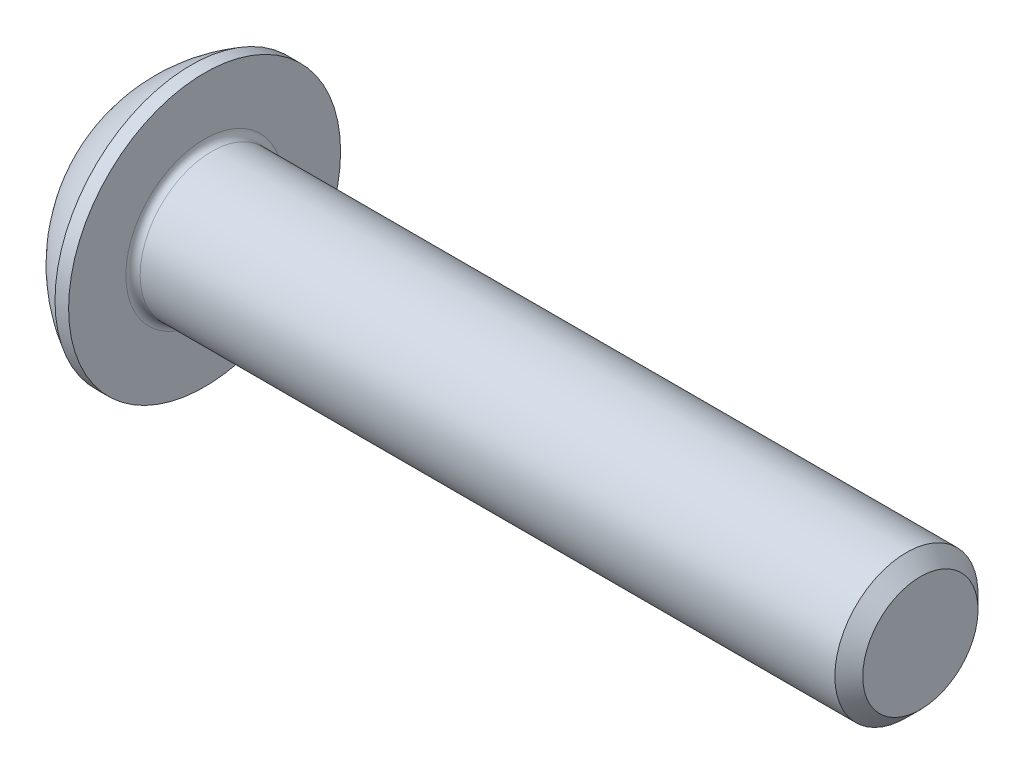
ISO-10303-21;
HEADER;
FILE_DESCRIPTION(('STEP AP214'),'2;1');
FILE_NAME('part.step','',(''),(''),'','','');
FILE_SCHEMA(('AUTOMOTIVE_DESIGN { 1 0 10303 214 1 1 1 1 }'));
ENDSEC;
DATA;
#1=APPLICATION_CONTEXT('core data for automotive mechanical design processes');
#2=APPLICATION_PROTOCOL_DEFINITION('international standard','automotive_design',2000,#1);
#3=PRODUCT_CONTEXT('',#1,'mechanical');
#4=PRODUCT('Part','Part','',(#3));
#5=PRODUCT_RELATED_PRODUCT_CATEGORY('part','',(#4));
#6=PRODUCT_DEFINITION_FORMATION('','',#4);
#7=PRODUCT_DEFINITION_CONTEXT('part definition',#1,'design');
#8=PRODUCT_DEFINITION('design','',#6,#7);
#9=PRODUCT_DEFINITION_SHAPE('','',#8);
#10=(LENGTH_UNIT() NAMED_UNIT(*) SI_UNIT(.MILLI.,.METRE.));
#11=(NAMED_UNIT(*) PLANE_ANGLE_UNIT() SI_UNIT($,.RADIAN.));
#12=(NAMED_UNIT(*) SI_UNIT($,.STERADIAN.) SOLID_ANGLE_UNIT());
#13=UNCERTAINTY_MEASURE_WITH_UNIT(LENGTH_MEASURE(1.E-05),#10,'distance_accuracy_value','');
#14=(GEOMETRIC_REPRESENTATION_CONTEXT(3) GLOBAL_UNCERTAINTY_ASSIGNED_CONTEXT((#13)) GLOBAL_UNIT_ASSIGNED_CONTEXT((#10,
#11,#12)) REPRESENTATION_CONTEXT('',''));
#15=CARTESIAN_POINT('',(0.,0.,0.));
#16=DIRECTION('',(0.,0.,1.));
#17=DIRECTION('',(1.,0.,0.));
#18=AXIS2_PLACEMENT_3D('',#15,#16,#17);
#19=CARTESIAN_POINT('',(0.,0.,0.));
#20=DIRECTION('',(-1.,0.,0.));
#21=DIRECTION('',(0.,0.,1.));
#22=AXIS2_PLACEMENT_3D('',#19,#20,#21);
#23=PLANE('',#22);
#24=CARTESIAN_POINT('',(0.,0.,0.));
#25=DIRECTION('',(-1.,0.,0.));
#26=DIRECTION('',(0.,0.,1.));
#27=AXIS2_PLACEMENT_3D('',#24,#25,#26);
#28=CIRCLE('',#27,1.9);
#29=CARTESIAN_POINT('',(0.,0.,1.9));
#30=VERTEX_POINT('',#29);
#31=EDGE_CURVE('E155',#30,#30,#28,.T.);
#32=ORIENTED_EDGE('',*,*,#31,.T.);
#33=EDGE_LOOP('',(#32));
#34=FACE_BOUND('',#33,.T.);
#35=DIRECTION('',(0.,-1.,0.));
#36=VECTOR('',#35,1.);
#37=CARTESIAN_POINT('',(0.,-0.721687836487031,1.25));
#38=LINE('',#37,#36);
#39=CARTESIAN_POINT('',(0.,0.721687836487033,1.25));
#40=VERTEX_POINT('',#39);
#41=CARTESIAN_POINT('',(0.,-0.721687836487031,1.25));
#42=VERTEX_POINT('',#41);
#43=EDGE_CURVE('E50',#40,#42,#38,.T.);
#44=ORIENTED_EDGE('',*,*,#43,.T.);
#45=DIRECTION('',(0.,-0.5,-0.866025403784439));
#46=VECTOR('',#45,1.);
#47=CARTESIAN_POINT('',(0.,-1.44337567297406,0.));
#48=LINE('',#47,#46);
#49=CARTESIAN_POINT('',(0.,-1.44337567297406,0.));
#50=VERTEX_POINT('',#49);
#51=EDGE_CURVE('E275',#42,#50,#48,.T.);
#52=ORIENTED_EDGE('',*,*,#51,.T.);
#53=DIRECTION('',(0.,0.5,-0.866025403784439));
#54=VECTOR('',#53,1.);
#55=CARTESIAN_POINT('',(0.,-0.721687836487032,-1.25));
#56=LINE('',#55,#54);
#57=CARTESIAN_POINT('',(0.,-0.721687836487032,-1.25));
#58=VERTEX_POINT('',#57);
#59=EDGE_CURVE('E130',#50,#58,#56,.T.);
#60=ORIENTED_EDGE('',*,*,#59,.T.);
#61=DIRECTION('',(0.,1.,0.));
#62=VECTOR('',#61,1.);
#63=CARTESIAN_POINT('',(0.,0.721687836487033,-1.25));
#64=LINE('',#63,#62);
#65=CARTESIAN_POINT('',(0.,0.721687836487033,-1.25));
#66=VERTEX_POINT('',#65);
#67=EDGE_CURVE('E278',#58,#66,#64,.T.);
#68=ORIENTED_EDGE('',*,*,#67,.T.);
#69=DIRECTION('',(0.,0.499999999999999,0.866025403784439));
#70=VECTOR('',#69,1.);
#71=CARTESIAN_POINT('',(0.,1.44337567297406,0.));
#72=LINE('',#71,#70);
#73=CARTESIAN_POINT('',(0.,1.44337567297406,0.));
#74=VERTEX_POINT('',#73);
#75=EDGE_CURVE('E280',#66,#74,#72,.T.);
#76=ORIENTED_EDGE('',*,*,#75,.T.);
#77=DIRECTION('',(0.,-0.499999999999999,0.866025403784439));
#78=VECTOR('',#77,1.);
#79=CARTESIAN_POINT('',(0.,0.721687836487033,1.25));
#80=LINE('',#79,#78);
#81=EDGE_CURVE('E282',#74,#40,#80,.T.);
#82=ORIENTED_EDGE('',*,*,#81,.T.);
#83=EDGE_LOOP('',(#44,#52,#60,#68,#76,#82));
#84=FACE_BOUND('',#83,.T.);
#85=ADVANCED_FACE('F35',(#34,#84),#23,.T.);
#86=CARTESIAN_POINT('',(3.88527472527473,0.,0.));
#87=DIRECTION('',(-1.,0.,0.));
#88=DIRECTION('',(0.,1.,0.));
#89=AXIS2_PLACEMENT_3D('',#86,#87,#88);
#90=SPHERICAL_SURFACE('',#89,4.32496932831421);
#91=CARTESIAN_POINT('',(1.82,0.,0.));
#92=DIRECTION('',(-1.,0.,0.));
#93=DIRECTION('',(0.,0.,1.));
#94=AXIS2_PLACEMENT_3D('',#91,#92,#93);
#95=CIRCLE('',#94,3.8);
#96=CARTESIAN_POINT('',(1.82,0.,3.8));
#97=VERTEX_POINT('',#96);
#98=EDGE_CURVE('E152',#97,#97,#95,.T.);
#99=ORIENTED_EDGE('',*,*,#98,.T.);
#100=EDGE_LOOP('',(#99));
#101=FACE_BOUND('',#100,.T.);
#102=ORIENTED_EDGE('',*,*,#31,.F.);
#103=EDGE_LOOP('',(#102));
#104=FACE_BOUND('',#103,.T.);
#105=ADVANCED_FACE('F176',(#101,#104),#90,.T.);
#106=CARTESIAN_POINT('',(0.,0.,0.));
#107=DIRECTION('',(-1.,0.,0.));
#108=DIRECTION('',(0.,0.,1.));
#109=AXIS2_PLACEMENT_3D('',#106,#107,#108);
#110=CYLINDRICAL_SURFACE('',#109,3.8);
#111=ORIENTED_EDGE('',*,*,#98,.F.);
#112=EDGE_LOOP('',(#111));
#113=FACE_BOUND('',#112,.T.);
#114=CARTESIAN_POINT('',(2.2,0.,0.));
#115=DIRECTION('',(-1.,0.,0.));
#116=DIRECTION('',(0.,0.,1.));
#117=AXIS2_PLACEMENT_3D('',#114,#115,#116);
#118=CIRCLE('',#117,3.8);
#119=CARTESIAN_POINT('',(2.2,0.,3.8));
#120=VERTEX_POINT('',#119);
#121=EDGE_CURVE('E149',#120,#120,#118,.T.);
#122=ORIENTED_EDGE('',*,*,#121,.T.);
#123=EDGE_LOOP('',(#122));
#124=FACE_BOUND('',#123,.T.);
#125=ADVANCED_FACE('F181',(#113,#124),#110,.T.);
#126=CARTESIAN_POINT('',(2.2,1.99999999999999,0.));
#127=DIRECTION('',(-1.,0.,0.));
#128=DIRECTION('',(0.,0.,1.));
#129=AXIS2_PLACEMENT_3D('',#126,#127,#128);
#130=PLANE('',#129);
#131=CARTESIAN_POINT('',(2.2,0.,0.));
#132=DIRECTION('',(-1.,0.,0.));
#133=DIRECTION('',(0.,0.,1.));
#134=AXIS2_PLACEMENT_3D('',#131,#132,#133);
#135=CIRCLE('',#134,2.2);
#136=CARTESIAN_POINT('',(2.2,0.,2.2));
#137=VERTEX_POINT('',#136);
#138=EDGE_CURVE('E43',#137,#137,#135,.T.);
#139=ORIENTED_EDGE('',*,*,#138,.T.);
#140=EDGE_LOOP('',(#139));
#141=FACE_BOUND('',#140,.T.);
#142=ORIENTED_EDGE('',*,*,#121,.F.);
#143=EDGE_LOOP('',(#142));
#144=FACE_BOUND('',#143,.T.);
#145=ADVANCED_FACE('F160',(#141,#144),#130,.F.);
#146=CARTESIAN_POINT('',(0.,0.,0.));
#147=DIRECTION('',(-1.,0.,0.));
#148=DIRECTION('',(0.,0.,1.));
#149=AXIS2_PLACEMENT_3D('',#146,#147,#148);
#150=CYLINDRICAL_SURFACE('',#149,2.);
#151=CARTESIAN_POINT('',(2.4,0.,0.));
#152=DIRECTION('',(-1.,0.,0.));
#153=DIRECTION('',(0.,0.,1.));
#154=AXIS2_PLACEMENT_3D('',#151,#152,#153);
#155=CIRCLE('',#154,2.);
#156=CARTESIAN_POINT('',(2.4,0.,2.));
#157=VERTEX_POINT('',#156);
#158=EDGE_CURVE('E11',#157,#157,#155,.F.);
#159=ORIENTED_EDGE('',*,*,#158,.T.);
#160=EDGE_LOOP('',(#159));
#161=FACE_BOUND('',#160,.T.);
#162=CARTESIAN_POINT('',(21.81,0.,0.));
#163=DIRECTION('',(-1.,0.,0.));
#164=DIRECTION('',(0.,0.,1.));
#165=AXIS2_PLACEMENT_3D('',#162,#163,#164);
#166=CIRCLE('',#165,2.);
#167=CARTESIAN_POINT('',(21.81,0.,2.));
#168=VERTEX_POINT('',#167);
#169=EDGE_CURVE('E146',#168,#168,#166,.T.);
#170=ORIENTED_EDGE('',*,*,#169,.T.);
#171=EDGE_LOOP('',(#170));
#172=FACE_BOUND('',#171,.T.);
#173=ADVANCED_FACE('F190',(#161,#172),#150,.T.);
#174=CARTESIAN_POINT('',(22.2,0.,0.));
#175=DIRECTION('',(-1.,0.,0.));
#176=DIRECTION('',(0.,0.,1.));
#177=AXIS2_PLACEMENT_3D('',#174,#175,#176);
#178=CONICAL_SURFACE('',#177,1.61,0.785398163397442);
#179=ORIENTED_EDGE('',*,*,#169,.F.);
#180=EDGE_LOOP('',(#179));
#181=FACE_BOUND('',#180,.T.);
#182=CARTESIAN_POINT('',(22.2,0.,0.));
#183=DIRECTION('',(-1.,0.,0.));
#184=DIRECTION('',(0.,0.,1.));
#185=AXIS2_PLACEMENT_3D('',#182,#183,#184);
#186=CIRCLE('',#185,1.61);
#187=CARTESIAN_POINT('',(22.2,0.,1.61));
#188=VERTEX_POINT('',#187);
#189=EDGE_CURVE('E142',#188,#188,#186,.T.);
#190=ORIENTED_EDGE('',*,*,#189,.T.);
#191=EDGE_LOOP('',(#190));
#192=FACE_BOUND('',#191,.T.);
#193=ADVANCED_FACE('F171',(#181,#192),#178,.T.);
#194=CARTESIAN_POINT('',(22.2,0.,0.));
#195=DIRECTION('',(-1.,0.,0.));
#196=DIRECTION('',(0.,0.,1.));
#197=AXIS2_PLACEMENT_3D('',#194,#195,#196);
#198=PLANE('',#197);
#199=ORIENTED_EDGE('',*,*,#189,.F.);
#200=EDGE_LOOP('',(#199));
#201=FACE_BOUND('',#200,.T.);
#202=ADVANCED_FACE('F164',(#201),#198,.F.);
#203=CARTESIAN_POINT('',(2.4,0.,0.));
#204=DIRECTION('',(-1.,0.,0.));
#205=DIRECTION('',(0.,0.,1.));
#206=AXIS2_PLACEMENT_3D('',#203,#204,#205);
#207=TOROIDAL_SURFACE('',#206,2.2,0.2);
#208=ORIENTED_EDGE('',*,*,#158,.F.);
#209=EDGE_LOOP('',(#208));
#210=FACE_BOUND('',#209,.T.);
#211=ORIENTED_EDGE('',*,*,#138,.F.);
#212=EDGE_LOOP('',(#211));
#213=FACE_BOUND('',#212,.T.);
#214=ADVANCED_FACE('F37',(#210,#213),#207,.F.);
#215=CARTESIAN_POINT('',(1.3,-1.44337567297406,0.));
#216=DIRECTION('',(0.,0.866025403784439,-0.5));
#217=DIRECTION('',(0.,0.5,0.866025403784439));
#218=AXIS2_PLACEMENT_3D('',#215,#216,#217);
#219=PLANE('',#218);
#220=DIRECTION('',(0.,-0.5,-0.866025403784439));
#221=VECTOR('',#220,1.);
#222=CARTESIAN_POINT('',(1.3,-1.44337567297406,0.));
#223=LINE('',#222,#221);
#224=CARTESIAN_POINT('',(1.3,-0.721687836487031,1.25));
#225=VERTEX_POINT('',#224);
#226=CARTESIAN_POINT('',(1.3,-1.08253175473055,0.625));
#227=VERTEX_POINT('',#226);
#228=EDGE_CURVE('E116',#225,#227,#223,.T.);
#229=ORIENTED_EDGE('',*,*,#228,.T.);
#230=CARTESIAN_POINT('',(1.3,-1.44337567297406,0.));
#231=VERTEX_POINT('',#230);
#232=EDGE_CURVE('E111',#227,#231,#223,.T.);
#233=ORIENTED_EDGE('',*,*,#232,.T.);
#234=DIRECTION('',(-1.,0.,0.));
#235=VECTOR('',#234,1.);
#236=CARTESIAN_POINT('',(1.3,-1.44337567297406,0.));
#237=LINE('',#236,#235);
#238=EDGE_CURVE('E113',#231,#50,#237,.T.);
#239=ORIENTED_EDGE('',*,*,#238,.T.);
#240=ORIENTED_EDGE('',*,*,#51,.F.);
#241=DIRECTION('',(-1.,0.,0.));
#242=VECTOR('',#241,1.);
#243=CARTESIAN_POINT('',(1.3,-0.721687836487031,1.25));
#244=LINE('',#243,#242);
#245=EDGE_CURVE('E271',#225,#42,#244,.T.);
#246=ORIENTED_EDGE('',*,*,#245,.F.);
#247=EDGE_LOOP('',(#229,#233,#239,#240,#246));
#248=FACE_BOUND('',#247,.T.);
#249=ADVANCED_FACE('F112',(#248),#219,.T.);
#250=CARTESIAN_POINT('',(1.3,-0.721687836487032,-1.25));
#251=DIRECTION('',(0.,0.866025403784439,0.5));
#252=DIRECTION('',(0.,-0.5,0.866025403784439));
#253=AXIS2_PLACEMENT_3D('',#250,#251,#252);
#254=PLANE('',#253);
#255=DIRECTION('',(0.,0.5,-0.866025403784439));
#256=VECTOR('',#255,1.);
#257=CARTESIAN_POINT('',(1.3,-0.721687836487032,-1.25));
#258=LINE('',#257,#256);
#259=CARTESIAN_POINT('',(1.3,-1.08253175473055,-0.625));
#260=VERTEX_POINT('',#259);
#261=EDGE_CURVE('E58',#231,#260,#258,.T.);
#262=ORIENTED_EDGE('',*,*,#261,.T.);
#263=CARTESIAN_POINT('',(1.3,-0.721687836487032,-1.25));
#264=VERTEX_POINT('',#263);
#265=EDGE_CURVE('E125',#260,#264,#258,.T.);
#266=ORIENTED_EDGE('',*,*,#265,.T.);
#267=DIRECTION('',(-1.,0.,0.));
#268=VECTOR('',#267,1.);
#269=CARTESIAN_POINT('',(1.3,-0.721687836487032,-1.25));
#270=LINE('',#269,#268);
#271=EDGE_CURVE('E132',#264,#58,#270,.T.);
#272=ORIENTED_EDGE('',*,*,#271,.T.);
#273=ORIENTED_EDGE('',*,*,#59,.F.);
#274=ORIENTED_EDGE('',*,*,#238,.F.);
#275=EDGE_LOOP('',(#262,#266,#272,#273,#274));
#276=FACE_BOUND('',#275,.T.);
#277=ADVANCED_FACE('F128',(#276),#254,.T.);
#278=CARTESIAN_POINT('',(1.3,0.721687836487033,-1.25));
#279=DIRECTION('',(0.,0.,1.));
#280=DIRECTION('',(1.,0.,0.));
#281=AXIS2_PLACEMENT_3D('',#278,#279,#280);
#282=PLANE('',#281);
#283=DIRECTION('',(0.,1.,0.));
#284=VECTOR('',#283,1.);
#285=CARTESIAN_POINT('',(1.3,0.721687836487033,-1.25));
#286=LINE('',#285,#284);
#287=CARTESIAN_POINT('',(1.3,0.,-1.25));
#288=VERTEX_POINT('',#287);
#289=EDGE_CURVE('E252',#264,#288,#286,.T.);
#290=ORIENTED_EDGE('',*,*,#289,.T.);
#291=CARTESIAN_POINT('',(1.3,0.721687836487033,-1.25));
#292=VERTEX_POINT('',#291);
#293=EDGE_CURVE('E124',#288,#292,#286,.T.);
#294=ORIENTED_EDGE('',*,*,#293,.T.);
#295=DIRECTION('',(-1.,0.,0.));
#296=VECTOR('',#295,1.);
#297=CARTESIAN_POINT('',(1.3,0.721687836487033,-1.25));
#298=LINE('',#297,#296);
#299=EDGE_CURVE('E137',#292,#66,#298,.T.);
#300=ORIENTED_EDGE('',*,*,#299,.T.);
#301=ORIENTED_EDGE('',*,*,#67,.F.);
#302=ORIENTED_EDGE('',*,*,#271,.F.);
#303=EDGE_LOOP('',(#290,#294,#300,#301,#302));
#304=FACE_BOUND('',#303,.T.);
#305=ADVANCED_FACE('F204',(#304),#282,.T.);
#306=CARTESIAN_POINT('',(1.3,1.44337567297406,0.));
#307=DIRECTION('',(0.,-0.866025403784439,0.499999999999999));
#308=DIRECTION('',(0.,-0.499999999999999,-0.866025403784439));
#309=AXIS2_PLACEMENT_3D('',#306,#307,#308);
#310=PLANE('',#309);
#311=DIRECTION('',(0.,0.499999999999999,0.866025403784439));
#312=VECTOR('',#311,1.);
#313=CARTESIAN_POINT('',(1.3,1.44337567297406,0.));
#314=LINE('',#313,#312);
#315=CARTESIAN_POINT('',(1.3,1.08253175473055,-0.624999999999999));
#316=VERTEX_POINT('',#315);
#317=EDGE_CURVE('E241',#292,#316,#314,.T.);
#318=ORIENTED_EDGE('',*,*,#317,.T.);
#319=CARTESIAN_POINT('',(1.3,1.44337567297406,0.));
#320=VERTEX_POINT('',#319);
#321=EDGE_CURVE('E246',#316,#320,#314,.T.);
#322=ORIENTED_EDGE('',*,*,#321,.T.);
#323=DIRECTION('',(-1.,0.,0.));
#324=VECTOR('',#323,1.);
#325=CARTESIAN_POINT('',(1.3,1.44337567297406,0.));
#326=LINE('',#325,#324);
#327=EDGE_CURVE('E286',#320,#74,#326,.T.);
#328=ORIENTED_EDGE('',*,*,#327,.T.);
#329=ORIENTED_EDGE('',*,*,#75,.F.);
#330=ORIENTED_EDGE('',*,*,#299,.F.);
#331=EDGE_LOOP('',(#318,#322,#328,#329,#330));
#332=FACE_BOUND('',#331,.T.);
#333=ADVANCED_FACE('F207',(#332),#310,.T.);
#334=CARTESIAN_POINT('',(1.3,0.721687836487033,1.25));
#335=DIRECTION('',(0.,-0.866025403784439,-0.499999999999999));
#336=DIRECTION('',(0.,0.499999999999999,-0.866025403784439));
#337=AXIS2_PLACEMENT_3D('',#334,#335,#336);
#338=PLANE('',#337);
#339=DIRECTION('',(0.,-0.499999999999999,0.866025403784439));
#340=VECTOR('',#339,1.);
#341=CARTESIAN_POINT('',(1.3,0.721687836487033,1.25));
#342=LINE('',#341,#340);
#343=CARTESIAN_POINT('',(1.3,1.08253175473055,0.624999999999999));
#344=VERTEX_POINT('',#343);
#345=EDGE_CURVE('E249',#320,#344,#342,.T.);
#346=ORIENTED_EDGE('',*,*,#345,.T.);
#347=CARTESIAN_POINT('',(1.3,0.721687836487033,1.25));
#348=VERTEX_POINT('',#347);
#349=EDGE_CURVE('E257',#344,#348,#342,.T.);
#350=ORIENTED_EDGE('',*,*,#349,.T.);
#351=DIRECTION('',(-1.,0.,0.));
#352=VECTOR('',#351,1.);
#353=CARTESIAN_POINT('',(1.3,0.721687836487033,1.25));
#354=LINE('',#353,#352);
#355=EDGE_CURVE('E270',#348,#40,#354,.T.);
#356=ORIENTED_EDGE('',*,*,#355,.T.);
#357=ORIENTED_EDGE('',*,*,#81,.F.);
#358=ORIENTED_EDGE('',*,*,#327,.F.);
#359=EDGE_LOOP('',(#346,#350,#356,#357,#358));
#360=FACE_BOUND('',#359,.T.);
#361=ADVANCED_FACE('F211',(#360),#338,.T.);
#362=CARTESIAN_POINT('',(1.3,-0.721687836487031,1.25));
#363=DIRECTION('',(0.,0.,-1.));
#364=DIRECTION('',(0.,1.,0.));
#365=AXIS2_PLACEMENT_3D('',#362,#363,#364);
#366=PLANE('',#365);
#367=DIRECTION('',(0.,-1.,0.));
#368=VECTOR('',#367,1.);
#369=CARTESIAN_POINT('',(1.3,-0.721687836487031,1.25));
#370=LINE('',#369,#368);
#371=CARTESIAN_POINT('',(1.3,0.,1.25));
#372=VERTEX_POINT('',#371);
#373=EDGE_CURVE('E263',#348,#372,#370,.T.);
#374=ORIENTED_EDGE('',*,*,#373,.T.);
#375=EDGE_CURVE('E265',#372,#225,#370,.T.);
#376=ORIENTED_EDGE('',*,*,#375,.T.);
#377=ORIENTED_EDGE('',*,*,#245,.T.);
#378=ORIENTED_EDGE('',*,*,#43,.F.);
#379=ORIENTED_EDGE('',*,*,#355,.F.);
#380=EDGE_LOOP('',(#374,#376,#377,#378,#379));
#381=FACE_BOUND('',#380,.T.);
#382=ADVANCED_FACE('F215',(#381),#366,.T.);
#383=CARTESIAN_POINT('',(1.3,-2.1650635094611,-1.25));
#384=DIRECTION('',(1.,0.,0.));
#385=DIRECTION('',(0.,0.,-1.));
#386=AXIS2_PLACEMENT_3D('',#383,#384,#385);
#387=PLANE('',#386);
#388=CARTESIAN_POINT('',(1.3,0.,0.));
#389=DIRECTION('',(-1.,0.,0.));
#390=DIRECTION('',(0.,0.,1.));
#391=AXIS2_PLACEMENT_3D('',#388,#389,#390);
#392=CIRCLE('',#391,1.25);
#393=EDGE_CURVE('E238',#316,#288,#392,.T.);
#394=ORIENTED_EDGE('',*,*,#393,.F.);
#395=ORIENTED_EDGE('',*,*,#317,.F.);
#396=ORIENTED_EDGE('',*,*,#293,.F.);
#397=EDGE_LOOP('',(#394,#395,#396));
#398=FACE_BOUND('',#397,.T.);
#399=ADVANCED_FACE('F219',(#398),#387,.F.);
#400=EDGE_CURVE('E143',#344,#316,#392,.T.);
#401=ORIENTED_EDGE('',*,*,#400,.F.);
#402=ORIENTED_EDGE('',*,*,#345,.F.);
#403=ORIENTED_EDGE('',*,*,#321,.F.);
#404=EDGE_LOOP('',(#401,#402,#403));
#405=FACE_BOUND('',#404,.T.);
#406=ADVANCED_FACE('F228',(#405),#387,.F.);
#407=EDGE_CURVE('E136',#372,#344,#392,.T.);
#408=ORIENTED_EDGE('',*,*,#407,.F.);
#409=ORIENTED_EDGE('',*,*,#373,.F.);
#410=ORIENTED_EDGE('',*,*,#349,.F.);
#411=EDGE_LOOP('',(#408,#409,#410));
#412=FACE_BOUND('',#411,.T.);
#413=ADVANCED_FACE('F233',(#412),#387,.F.);
#414=EDGE_CURVE('E131',#227,#372,#392,.T.);
#415=ORIENTED_EDGE('',*,*,#414,.F.);
#416=ORIENTED_EDGE('',*,*,#228,.F.);
#417=ORIENTED_EDGE('',*,*,#375,.F.);
#418=EDGE_LOOP('',(#415,#416,#417));
#419=FACE_BOUND('',#418,.T.);
#420=ADVANCED_FACE('F226',(#419),#387,.F.);
#421=EDGE_CURVE('E122',#260,#227,#392,.T.);
#422=ORIENTED_EDGE('',*,*,#421,.F.);
#423=ORIENTED_EDGE('',*,*,#261,.F.);
#424=ORIENTED_EDGE('',*,*,#232,.F.);
#425=EDGE_LOOP('',(#422,#423,#424));
#426=FACE_BOUND('',#425,.T.);
#427=ADVANCED_FACE('F121',(#426),#387,.F.);
#428=EDGE_CURVE('E244',#288,#260,#392,.T.);
#429=ORIENTED_EDGE('',*,*,#428,.F.);
#430=ORIENTED_EDGE('',*,*,#289,.F.);
#431=ORIENTED_EDGE('',*,*,#265,.F.);
#432=EDGE_LOOP('',(#429,#430,#431));
#433=FACE_BOUND('',#432,.T.);
#434=ADVANCED_FACE('F199',(#433),#387,.F.);
#435=CARTESIAN_POINT('',(2.02168783648704,0.,0.));
#436=DIRECTION('',(-1.,0.,0.));
#437=DIRECTION('',(0.,0.,1.));
#438=AXIS2_PLACEMENT_3D('',#435,#436,#437);
#439=CONICAL_SURFACE('',#438,0.,1.04719755119659);
#440=ORIENTED_EDGE('',*,*,#407,.T.);
#441=ORIENTED_EDGE('',*,*,#400,.T.);
#442=ORIENTED_EDGE('',*,*,#393,.T.);
#443=ORIENTED_EDGE('',*,*,#428,.T.);
#444=ORIENTED_EDGE('',*,*,#421,.T.);
#445=ORIENTED_EDGE('',*,*,#414,.T.);
#446=EDGE_LOOP('',(#440,#441,#442,#443,#444,#445));
#447=FACE_BOUND('',#446,.T.);
#448=CARTESIAN_POINT('',(2.02168783648704,0.,0.));
#449=VERTEX_POINT('',#448);
#450=VERTEX_LOOP('',#449);
#451=FACE_BOUND('',#450,.T.);
#452=ADVANCED_FACE('F197',(#447,#451),#439,.F.);
#453=CLOSED_SHELL('',(#85,#105,#125,#145,#173,#193,#202,#214,#249,#277,#305,#333,#361,#382,#399,
#406,#413,#420,#427,#434,#452));
#454=MANIFOLD_SOLID_BREP('B2',#453);
#455=ADVANCED_BREP_SHAPE_REPRESENTATION('',(#18,#454),#14);
#456=SHAPE_DEFINITION_REPRESENTATION(#9,#455);
ENDSEC;
END-ISO-10303-21;
